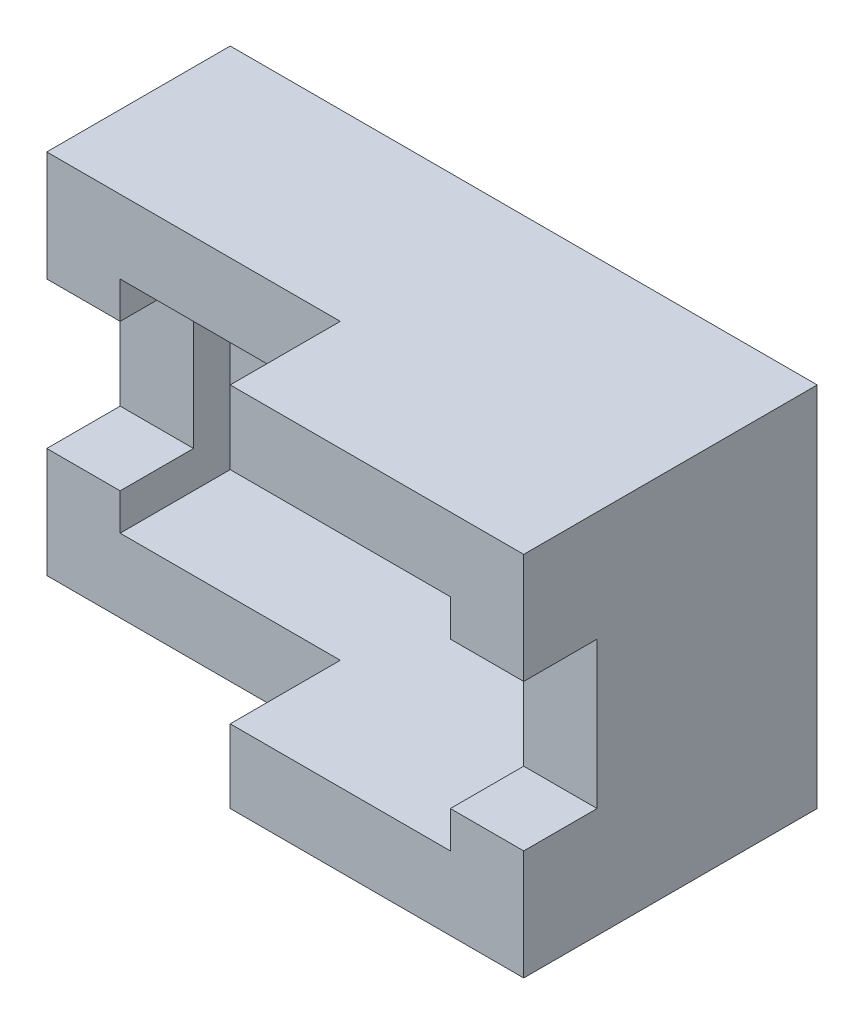
ISO-10303-21;
HEADER;
FILE_DESCRIPTION(('STEP AP214'),'2;1');
FILE_NAME('part.step','',(''),(''),'','','');
FILE_SCHEMA(('AUTOMOTIVE_DESIGN { 1 0 10303 214 1 1 1 1 }'));
ENDSEC;
DATA;
#1=APPLICATION_CONTEXT('core data for automotive mechanical design processes');
#2=APPLICATION_PROTOCOL_DEFINITION('international standard','automotive_design',2000,#1);
#3=PRODUCT_CONTEXT('',#1,'mechanical');
#4=PRODUCT('Part','Part','',(#3));
#5=PRODUCT_RELATED_PRODUCT_CATEGORY('part','',(#4));
#6=PRODUCT_DEFINITION_FORMATION('','',#4);
#7=PRODUCT_DEFINITION_CONTEXT('part definition',#1,'design');
#8=PRODUCT_DEFINITION('design','',#6,#7);
#9=PRODUCT_DEFINITION_SHAPE('','',#8);
#10=(LENGTH_UNIT() NAMED_UNIT(*) SI_UNIT(.MILLI.,.METRE.));
#11=(NAMED_UNIT(*) PLANE_ANGLE_UNIT() SI_UNIT($,.RADIAN.));
#12=(NAMED_UNIT(*) SI_UNIT($,.STERADIAN.) SOLID_ANGLE_UNIT());
#13=UNCERTAINTY_MEASURE_WITH_UNIT(LENGTH_MEASURE(1.E-05),#10,'distance_accuracy_value','');
#14=(GEOMETRIC_REPRESENTATION_CONTEXT(3) GLOBAL_UNCERTAINTY_ASSIGNED_CONTEXT((#13)) GLOBAL_UNIT_ASSIGNED_CONTEXT((#10,
#11,#12)) REPRESENTATION_CONTEXT('',''));
#15=CARTESIAN_POINT('',(0.,0.,0.));
#16=DIRECTION('',(0.,0.,1.));
#17=DIRECTION('',(1.,0.,0.));
#18=AXIS2_PLACEMENT_3D('',#15,#16,#17);
#19=CARTESIAN_POINT('',(0.,0.,50.));
#20=DIRECTION('',(0.,0.,-1.));
#21=DIRECTION('',(-1.,0.,0.));
#22=AXIS2_PLACEMENT_3D('',#19,#20,#21);
#23=PLANE('',#22);
#24=DIRECTION('',(0.,-1.,0.));
#25=VECTOR('',#24,1.);
#26=CARTESIAN_POINT('',(80.,0.,50.));
#27=LINE('',#26,#25);
#28=CARTESIAN_POINT('',(80.,20.,50.));
#29=VERTEX_POINT('',#28);
#30=CARTESIAN_POINT('',(80.,0.,50.));
#31=VERTEX_POINT('',#30);
#32=EDGE_CURVE('E239',#29,#31,#27,.T.);
#33=ORIENTED_EDGE('',*,*,#32,.F.);
#34=DIRECTION('',(1.,0.,0.));
#35=VECTOR('',#34,1.);
#36=CARTESIAN_POINT('',(140.,20.,50.));
#37=LINE('',#36,#35);
#38=CARTESIAN_POINT('',(20.,20.,50.));
#39=VERTEX_POINT('',#38);
#40=EDGE_CURVE('E286',#39,#29,#37,.T.);
#41=ORIENTED_EDGE('',*,*,#40,.F.);
#42=DIRECTION('',(0.,-1.,0.));
#43=VECTOR('',#42,1.);
#44=CARTESIAN_POINT('',(20.,80.,50.));
#45=LINE('',#44,#43);
#46=CARTESIAN_POINT('',(20.,30.,50.));
#47=VERTEX_POINT('',#46);
#48=EDGE_CURVE('E297',#47,#39,#45,.T.);
#49=ORIENTED_EDGE('',*,*,#48,.F.);
#50=DIRECTION('',(1.,0.,0.));
#51=VECTOR('',#50,1.);
#52=CARTESIAN_POINT('',(0.,30.,50.));
#53=LINE('',#52,#51);
#54=CARTESIAN_POINT('',(0.,30.,50.));
#55=VERTEX_POINT('',#54);
#56=EDGE_CURVE('E369',#55,#47,#53,.T.);
#57=ORIENTED_EDGE('',*,*,#56,.F.);
#58=DIRECTION('',(0.,-1.,0.));
#59=VECTOR('',#58,1.);
#60=CARTESIAN_POINT('',(0.,0.,50.));
#61=LINE('',#60,#59);
#62=CARTESIAN_POINT('',(0.,0.,50.));
#63=VERTEX_POINT('',#62);
#64=EDGE_CURVE('E406',#55,#63,#61,.T.);
#65=ORIENTED_EDGE('',*,*,#64,.T.);
#66=DIRECTION('',(1.,0.,0.));
#67=VECTOR('',#66,1.);
#68=CARTESIAN_POINT('',(0.,0.,50.));
#69=LINE('',#68,#67);
#70=EDGE_CURVE('E405',#63,#31,#69,.T.);
#71=ORIENTED_EDGE('',*,*,#70,.T.);
#72=EDGE_LOOP('',(#33,#41,#49,#57,#65,#71));
#73=FACE_BOUND('',#72,.T.);
#74=ADVANCED_FACE('F33',(#73),#23,.F.);
#75=DIRECTION('',(0.,-1.,0.));
#76=VECTOR('',#75,1.);
#77=CARTESIAN_POINT('',(80.,100.,50.));
#78=LINE('',#77,#76);
#79=CARTESIAN_POINT('',(80.,100.,50.));
#80=VERTEX_POINT('',#79);
#81=CARTESIAN_POINT('',(80.,80.,50.));
#82=VERTEX_POINT('',#81);
#83=EDGE_CURVE('E257',#80,#82,#78,.T.);
#84=ORIENTED_EDGE('',*,*,#83,.F.);
#85=DIRECTION('',(-1.,0.,0.));
#86=VECTOR('',#85,1.);
#87=CARTESIAN_POINT('',(0.,100.,50.));
#88=LINE('',#87,#86);
#89=CARTESIAN_POINT('',(0.,100.,50.));
#90=VERTEX_POINT('',#89);
#91=EDGE_CURVE('E409',#80,#90,#88,.T.);
#92=ORIENTED_EDGE('',*,*,#91,.T.);
#93=CARTESIAN_POINT('',(0.,70.,50.));
#94=VERTEX_POINT('',#93);
#95=EDGE_CURVE('E402',#90,#94,#61,.T.);
#96=ORIENTED_EDGE('',*,*,#95,.T.);
#97=DIRECTION('',(-1.,0.,0.));
#98=VECTOR('',#97,1.);
#99=CARTESIAN_POINT('',(0.,70.,50.));
#100=LINE('',#99,#98);
#101=CARTESIAN_POINT('',(20.,70.,50.));
#102=VERTEX_POINT('',#101);
#103=EDGE_CURVE('E379',#102,#94,#100,.T.);
#104=ORIENTED_EDGE('',*,*,#103,.F.);
#105=CARTESIAN_POINT('',(20.,80.,50.));
#106=VERTEX_POINT('',#105);
#107=EDGE_CURVE('E298',#106,#102,#45,.T.);
#108=ORIENTED_EDGE('',*,*,#107,.F.);
#109=DIRECTION('',(-1.,0.,0.));
#110=VECTOR('',#109,1.);
#111=CARTESIAN_POINT('',(140.,80.,50.));
#112=LINE('',#111,#110);
#113=EDGE_CURVE('E281',#82,#106,#112,.T.);
#114=ORIENTED_EDGE('',*,*,#113,.F.);
#115=EDGE_LOOP('',(#84,#92,#96,#104,#108,#114));
#116=FACE_BOUND('',#115,.T.);
#117=ADVANCED_FACE('F440',(#116),#23,.F.);
#118=CARTESIAN_POINT('',(0.,0.,50.));
#119=DIRECTION('',(1.,0.,0.));
#120=DIRECTION('',(0.,0.,-1.));
#121=AXIS2_PLACEMENT_3D('',#118,#119,#120);
#122=PLANE('',#121);
#123=DIRECTION('',(0.,-1.,0.));
#124=VECTOR('',#123,1.);
#125=CARTESIAN_POINT('',(0.,70.,30.));
#126=LINE('',#125,#124);
#127=CARTESIAN_POINT('',(0.,70.,30.));
#128=VERTEX_POINT('',#127);
#129=CARTESIAN_POINT('',(0.,30.,30.));
#130=VERTEX_POINT('',#129);
#131=EDGE_CURVE('E375',#128,#130,#126,.T.);
#132=ORIENTED_EDGE('',*,*,#131,.F.);
#133=DIRECTION('',(0.,0.,1.));
#134=VECTOR('',#133,1.);
#135=CARTESIAN_POINT('',(0.,70.,30.));
#136=LINE('',#135,#134);
#137=EDGE_CURVE('E392',#128,#94,#136,.T.);
#138=ORIENTED_EDGE('',*,*,#137,.T.);
#139=ORIENTED_EDGE('',*,*,#95,.F.);
#140=DIRECTION('',(0.,0.,-1.));
#141=VECTOR('',#140,1.);
#142=CARTESIAN_POINT('',(0.,100.,50.));
#143=LINE('',#142,#141);
#144=CARTESIAN_POINT('',(0.,100.,0.));
#145=VERTEX_POINT('',#144);
#146=EDGE_CURVE('E411',#90,#145,#143,.T.);
#147=ORIENTED_EDGE('',*,*,#146,.T.);
#148=DIRECTION('',(0.,-1.,0.));
#149=VECTOR('',#148,1.);
#150=CARTESIAN_POINT('',(0.,0.,0.));
#151=LINE('',#150,#149);
#152=CARTESIAN_POINT('',(0.,0.,0.));
#153=VERTEX_POINT('',#152);
#154=EDGE_CURVE('E395',#145,#153,#151,.T.);
#155=ORIENTED_EDGE('',*,*,#154,.T.);
#156=DIRECTION('',(0.,0.,-1.));
#157=VECTOR('',#156,1.);
#158=CARTESIAN_POINT('',(0.,0.,50.));
#159=LINE('',#158,#157);
#160=EDGE_CURVE('E11',#63,#153,#159,.T.);
#161=ORIENTED_EDGE('',*,*,#160,.F.);
#162=ORIENTED_EDGE('',*,*,#64,.F.);
#163=DIRECTION('',(0.,0.,1.));
#164=VECTOR('',#163,1.);
#165=CARTESIAN_POINT('',(0.,30.,30.));
#166=LINE('',#165,#164);
#167=EDGE_CURVE('E388',#130,#55,#166,.T.);
#168=ORIENTED_EDGE('',*,*,#167,.F.);
#169=EDGE_LOOP('',(#132,#138,#139,#147,#155,#161,#162,#168));
#170=FACE_BOUND('',#169,.T.);
#171=ADVANCED_FACE('F35',(#170),#122,.F.);
#172=CARTESIAN_POINT('',(0.,0.,50.));
#173=DIRECTION('',(0.,1.,0.));
#174=DIRECTION('',(0.,0.,1.));
#175=AXIS2_PLACEMENT_3D('',#172,#173,#174);
#176=PLANE('',#175);
#177=DIRECTION('',(1.,0.,0.));
#178=VECTOR('',#177,1.);
#179=CARTESIAN_POINT('',(0.,0.,0.));
#180=LINE('',#179,#178);
#181=CARTESIAN_POINT('',(160.,0.,0.));
#182=VERTEX_POINT('',#181);
#183=EDGE_CURVE('E223',#153,#182,#180,.T.);
#184=ORIENTED_EDGE('',*,*,#183,.T.);
#185=DIRECTION('',(0.,0.,-1.));
#186=VECTOR('',#185,1.);
#187=CARTESIAN_POINT('',(160.,0.,50.));
#188=LINE('',#187,#186);
#189=CARTESIAN_POINT('',(160.,0.,80.));
#190=VERTEX_POINT('',#189);
#191=EDGE_CURVE('E41',#190,#182,#188,.T.);
#192=ORIENTED_EDGE('',*,*,#191,.F.);
#193=DIRECTION('',(1.,0.,0.));
#194=VECTOR('',#193,1.);
#195=CARTESIAN_POINT('',(160.,0.,80.));
#196=LINE('',#195,#194);
#197=CARTESIAN_POINT('',(80.,0.,80.));
#198=VERTEX_POINT('',#197);
#199=EDGE_CURVE('E222',#198,#190,#196,.T.);
#200=ORIENTED_EDGE('',*,*,#199,.F.);
#201=DIRECTION('',(0.,0.,-1.));
#202=VECTOR('',#201,1.);
#203=CARTESIAN_POINT('',(80.,0.,80.));
#204=LINE('',#203,#202);
#205=EDGE_CURVE('E252',#198,#31,#204,.T.);
#206=ORIENTED_EDGE('',*,*,#205,.T.);
#207=ORIENTED_EDGE('',*,*,#70,.F.);
#208=ORIENTED_EDGE('',*,*,#160,.T.);
#209=EDGE_LOOP('',(#184,#192,#200,#206,#207,#208));
#210=FACE_BOUND('',#209,.T.);
#211=ADVANCED_FACE('F219',(#210),#176,.F.);
#212=CARTESIAN_POINT('',(160.,0.,50.));
#213=DIRECTION('',(-1.,0.,0.));
#214=DIRECTION('',(0.,0.,1.));
#215=AXIS2_PLACEMENT_3D('',#212,#213,#214);
#216=PLANE('',#215);
#217=DIRECTION('',(0.,1.,0.));
#218=VECTOR('',#217,1.);
#219=CARTESIAN_POINT('',(160.,70.,60.));
#220=LINE('',#219,#218);
#221=CARTESIAN_POINT('',(160.,30.,60.));
#222=VERTEX_POINT('',#221);
#223=CARTESIAN_POINT('',(160.,70.,60.));
#224=VERTEX_POINT('',#223);
#225=EDGE_CURVE('E452',#222,#224,#220,.T.);
#226=ORIENTED_EDGE('',*,*,#225,.F.);
#227=DIRECTION('',(0.,0.,1.));
#228=VECTOR('',#227,1.);
#229=CARTESIAN_POINT('',(160.,30.,30.));
#230=LINE('',#229,#228);
#231=CARTESIAN_POINT('',(160.,30.,80.));
#232=VERTEX_POINT('',#231);
#233=EDGE_CURVE('E48',#222,#232,#230,.T.);
#234=ORIENTED_EDGE('',*,*,#233,.T.);
#235=DIRECTION('',(0.,1.,0.));
#236=VECTOR('',#235,1.);
#237=CARTESIAN_POINT('',(160.,30.,80.));
#238=LINE('',#237,#236);
#239=EDGE_CURVE('E228',#190,#232,#238,.T.);
#240=ORIENTED_EDGE('',*,*,#239,.F.);
#241=ORIENTED_EDGE('',*,*,#191,.T.);
#242=DIRECTION('',(0.,1.,0.));
#243=VECTOR('',#242,1.);
#244=CARTESIAN_POINT('',(160.,0.,0.));
#245=LINE('',#244,#243);
#246=CARTESIAN_POINT('',(160.,100.,0.));
#247=VERTEX_POINT('',#246);
#248=EDGE_CURVE('E415',#182,#247,#245,.T.);
#249=ORIENTED_EDGE('',*,*,#248,.T.);
#250=DIRECTION('',(0.,0.,-1.));
#251=VECTOR('',#250,1.);
#252=CARTESIAN_POINT('',(160.,100.,50.));
#253=LINE('',#252,#251);
#254=CARTESIAN_POINT('',(160.,100.,80.));
#255=VERTEX_POINT('',#254);
#256=EDGE_CURVE('E226',#255,#247,#253,.T.);
#257=ORIENTED_EDGE('',*,*,#256,.F.);
#258=DIRECTION('',(0.,1.,0.));
#259=VECTOR('',#258,1.);
#260=CARTESIAN_POINT('',(160.,70.,80.));
#261=LINE('',#260,#259);
#262=CARTESIAN_POINT('',(160.,70.,80.));
#263=VERTEX_POINT('',#262);
#264=EDGE_CURVE('E272',#263,#255,#261,.T.);
#265=ORIENTED_EDGE('',*,*,#264,.F.);
#266=DIRECTION('',(0.,0.,1.));
#267=VECTOR('',#266,1.);
#268=CARTESIAN_POINT('',(160.,70.,30.));
#269=LINE('',#268,#267);
#270=EDGE_CURVE('E361',#224,#263,#269,.T.);
#271=ORIENTED_EDGE('',*,*,#270,.F.);
#272=EDGE_LOOP('',(#226,#234,#240,#241,#249,#257,#265,#271));
#273=FACE_BOUND('',#272,.T.);
#274=ADVANCED_FACE('F230',(#273),#216,.F.);
#275=CARTESIAN_POINT('',(0.,100.,50.));
#276=DIRECTION('',(0.,-1.,0.));
#277=DIRECTION('',(0.,0.,-1.));
#278=AXIS2_PLACEMENT_3D('',#275,#276,#277);
#279=PLANE('',#278);
#280=DIRECTION('',(-1.,0.,0.));
#281=VECTOR('',#280,1.);
#282=CARTESIAN_POINT('',(0.,100.,0.));
#283=LINE('',#282,#281);
#284=EDGE_CURVE('E417',#247,#145,#283,.T.);
#285=ORIENTED_EDGE('',*,*,#284,.T.);
#286=ORIENTED_EDGE('',*,*,#146,.F.);
#287=ORIENTED_EDGE('',*,*,#91,.F.);
#288=DIRECTION('',(0.,0.,-1.));
#289=VECTOR('',#288,1.);
#290=CARTESIAN_POINT('',(80.,100.,80.));
#291=LINE('',#290,#289);
#292=CARTESIAN_POINT('',(80.,100.,80.));
#293=VERTEX_POINT('',#292);
#294=EDGE_CURVE('E279',#293,#80,#291,.T.);
#295=ORIENTED_EDGE('',*,*,#294,.F.);
#296=DIRECTION('',(-1.,0.,0.));
#297=VECTOR('',#296,1.);
#298=CARTESIAN_POINT('',(160.,100.,80.));
#299=LINE('',#298,#297);
#300=EDGE_CURVE('E258',#255,#293,#299,.T.);
#301=ORIENTED_EDGE('',*,*,#300,.F.);
#302=ORIENTED_EDGE('',*,*,#256,.T.);
#303=EDGE_LOOP('',(#285,#286,#287,#295,#301,#302));
#304=FACE_BOUND('',#303,.T.);
#305=ADVANCED_FACE('F425',(#304),#279,.F.);
#306=CARTESIAN_POINT('',(0.,0.,0.));
#307=DIRECTION('',(0.,0.,-1.));
#308=DIRECTION('',(-1.,0.,0.));
#309=AXIS2_PLACEMENT_3D('',#306,#307,#308);
#310=PLANE('',#309);
#311=DIRECTION('',(0.,1.,0.));
#312=VECTOR('',#311,1.);
#313=CARTESIAN_POINT('',(90.,60.,0.));
#314=LINE('',#313,#312);
#315=CARTESIAN_POINT('',(90.,40.,0.));
#316=VERTEX_POINT('',#315);
#317=CARTESIAN_POINT('',(90.,60.,0.));
#318=VERTEX_POINT('',#317);
#319=EDGE_CURVE('E304',#316,#318,#314,.T.);
#320=ORIENTED_EDGE('',*,*,#319,.F.);
#321=DIRECTION('',(-1.,0.,0.));
#322=VECTOR('',#321,1.);
#323=CARTESIAN_POINT('',(90.,40.,0.));
#324=LINE('',#323,#322);
#325=CARTESIAN_POINT('',(120.,40.,0.));
#326=VERTEX_POINT('',#325);
#327=EDGE_CURVE('E315',#326,#316,#324,.T.);
#328=ORIENTED_EDGE('',*,*,#327,.F.);
#329=DIRECTION('',(0.,-1.,0.));
#330=VECTOR('',#329,1.);
#331=CARTESIAN_POINT('',(120.,60.,0.));
#332=LINE('',#331,#330);
#333=CARTESIAN_POINT('',(120.,60.,0.));
#334=VERTEX_POINT('',#333);
#335=EDGE_CURVE('E326',#334,#326,#332,.T.);
#336=ORIENTED_EDGE('',*,*,#335,.F.);
#337=DIRECTION('',(1.,0.,0.));
#338=VECTOR('',#337,1.);
#339=CARTESIAN_POINT('',(90.,60.,0.));
#340=LINE('',#339,#338);
#341=EDGE_CURVE('E323',#318,#334,#340,.T.);
#342=ORIENTED_EDGE('',*,*,#341,.F.);
#343=EDGE_LOOP('',(#320,#328,#336,#342));
#344=FACE_BOUND('',#343,.T.);
#345=DIRECTION('',(0.,1.,0.));
#346=VECTOR('',#345,1.);
#347=CARTESIAN_POINT('',(40.,60.,0.));
#348=LINE('',#347,#346);
#349=CARTESIAN_POINT('',(40.,40.,0.));
#350=VERTEX_POINT('',#349);
#351=CARTESIAN_POINT('',(40.,60.,0.));
#352=VERTEX_POINT('',#351);
#353=EDGE_CURVE('E333',#350,#352,#348,.T.);
#354=ORIENTED_EDGE('',*,*,#353,.F.);
#355=DIRECTION('',(-1.,0.,0.));
#356=VECTOR('',#355,1.);
#357=CARTESIAN_POINT('',(40.,40.,0.));
#358=LINE('',#357,#356);
#359=CARTESIAN_POINT('',(70.,40.,0.));
#360=VERTEX_POINT('',#359);
#361=EDGE_CURVE('E343',#360,#350,#358,.T.);
#362=ORIENTED_EDGE('',*,*,#361,.F.);
#363=DIRECTION('',(0.,-1.,0.));
#364=VECTOR('',#363,1.);
#365=CARTESIAN_POINT('',(70.,60.,0.));
#366=LINE('',#365,#364);
#367=CARTESIAN_POINT('',(70.,60.,0.));
#368=VERTEX_POINT('',#367);
#369=EDGE_CURVE('E354',#368,#360,#366,.T.);
#370=ORIENTED_EDGE('',*,*,#369,.F.);
#371=DIRECTION('',(1.,0.,0.));
#372=VECTOR('',#371,1.);
#373=CARTESIAN_POINT('',(40.,60.,0.));
#374=LINE('',#373,#372);
#375=EDGE_CURVE('E351',#352,#368,#374,.T.);
#376=ORIENTED_EDGE('',*,*,#375,.F.);
#377=EDGE_LOOP('',(#354,#362,#370,#376));
#378=FACE_BOUND('',#377,.T.);
#379=ORIENTED_EDGE('',*,*,#154,.F.);
#380=ORIENTED_EDGE('',*,*,#284,.F.);
#381=ORIENTED_EDGE('',*,*,#248,.F.);
#382=ORIENTED_EDGE('',*,*,#183,.F.);
#383=EDGE_LOOP('',(#379,#380,#381,#382));
#384=FACE_BOUND('',#383,.T.);
#385=ADVANCED_FACE('F431',(#344,#378,#384),#310,.T.);
#386=CARTESIAN_POINT('',(0.,70.,30.));
#387=DIRECTION('',(0.,1.,0.));
#388=DIRECTION('',(0.,0.,1.));
#389=AXIS2_PLACEMENT_3D('',#386,#387,#388);
#390=PLANE('',#389);
#391=ORIENTED_EDGE('',*,*,#103,.T.);
#392=ORIENTED_EDGE('',*,*,#137,.F.);
#393=DIRECTION('',(-1.,0.,0.));
#394=VECTOR('',#393,1.);
#395=CARTESIAN_POINT('',(0.,70.,30.));
#396=LINE('',#395,#394);
#397=CARTESIAN_POINT('',(20.,70.,30.));
#398=VERTEX_POINT('',#397);
#399=EDGE_CURVE('E385',#398,#128,#396,.T.);
#400=ORIENTED_EDGE('',*,*,#399,.F.);
#401=DIRECTION('',(0.,0.,1.));
#402=VECTOR('',#401,1.);
#403=CARTESIAN_POINT('',(20.,70.,30.));
#404=LINE('',#403,#402);
#405=EDGE_CURVE('E396',#398,#102,#404,.T.);
#406=ORIENTED_EDGE('',*,*,#405,.T.);
#407=EDGE_LOOP('',(#391,#392,#400,#406));
#408=FACE_BOUND('',#407,.T.);
#409=ADVANCED_FACE('F488',(#408),#390,.F.);
#410=CARTESIAN_POINT('',(0.,30.,30.));
#411=DIRECTION('',(0.,-1.,0.));
#412=DIRECTION('',(0.,0.,-1.));
#413=AXIS2_PLACEMENT_3D('',#410,#411,#412);
#414=PLANE('',#413);
#415=ORIENTED_EDGE('',*,*,#56,.T.);
#416=DIRECTION('',(0.,0.,1.));
#417=VECTOR('',#416,1.);
#418=CARTESIAN_POINT('',(20.,30.,30.));
#419=LINE('',#418,#417);
#420=CARTESIAN_POINT('',(20.,30.,30.));
#421=VERTEX_POINT('',#420);
#422=EDGE_CURVE('E399',#421,#47,#419,.T.);
#423=ORIENTED_EDGE('',*,*,#422,.F.);
#424=DIRECTION('',(1.,0.,0.));
#425=VECTOR('',#424,1.);
#426=CARTESIAN_POINT('',(0.,30.,30.));
#427=LINE('',#426,#425);
#428=EDGE_CURVE('E378',#130,#421,#427,.T.);
#429=ORIENTED_EDGE('',*,*,#428,.F.);
#430=ORIENTED_EDGE('',*,*,#167,.T.);
#431=EDGE_LOOP('',(#415,#423,#429,#430));
#432=FACE_BOUND('',#431,.T.);
#433=ADVANCED_FACE('F482',(#432),#414,.F.);
#434=CARTESIAN_POINT('',(0.,0.,30.));
#435=DIRECTION('',(0.,0.,1.));
#436=DIRECTION('',(1.,0.,0.));
#437=AXIS2_PLACEMENT_3D('',#434,#435,#436);
#438=PLANE('',#437);
#439=ORIENTED_EDGE('',*,*,#131,.T.);
#440=ORIENTED_EDGE('',*,*,#428,.T.);
#441=DIRECTION('',(0.,1.,0.));
#442=VECTOR('',#441,1.);
#443=CARTESIAN_POINT('',(20.,70.,30.));
#444=LINE('',#443,#442);
#445=EDGE_CURVE('E382',#421,#398,#444,.T.);
#446=ORIENTED_EDGE('',*,*,#445,.T.);
#447=ORIENTED_EDGE('',*,*,#399,.T.);
#448=EDGE_LOOP('',(#439,#440,#446,#447));
#449=FACE_BOUND('',#448,.T.);
#450=ADVANCED_FACE('F485',(#449),#438,.T.);
#451=CARTESIAN_POINT('',(160.,30.,30.));
#452=DIRECTION('',(0.,-1.,0.));
#453=DIRECTION('',(1.,0.,0.));
#454=AXIS2_PLACEMENT_3D('',#451,#452,#453);
#455=PLANE('',#454);
#456=ORIENTED_EDGE('',*,*,#233,.F.);
#457=DIRECTION('',(-1.,0.,0.));
#458=VECTOR('',#457,1.);
#459=CARTESIAN_POINT('',(160.,30.,60.));
#460=LINE('',#459,#458);
#461=CARTESIAN_POINT('',(140.,30.,60.));
#462=VERTEX_POINT('',#461);
#463=EDGE_CURVE('E243',#222,#462,#460,.T.);
#464=ORIENTED_EDGE('',*,*,#463,.T.);
#465=DIRECTION('',(0.,0.,1.));
#466=VECTOR('',#465,1.);
#467=CARTESIAN_POINT('',(140.,30.,30.));
#468=LINE('',#467,#466);
#469=CARTESIAN_POINT('',(140.,30.,80.));
#470=VERTEX_POINT('',#469);
#471=EDGE_CURVE('E370',#462,#470,#468,.T.);
#472=ORIENTED_EDGE('',*,*,#471,.T.);
#473=DIRECTION('',(-1.,0.,0.));
#474=VECTOR('',#473,1.);
#475=CARTESIAN_POINT('',(140.,30.,80.));
#476=LINE('',#475,#474);
#477=EDGE_CURVE('E233',#232,#470,#476,.T.);
#478=ORIENTED_EDGE('',*,*,#477,.F.);
#479=EDGE_LOOP('',(#456,#464,#472,#478));
#480=FACE_BOUND('',#479,.T.);
#481=ADVANCED_FACE('F465',(#480),#455,.F.);
#482=CARTESIAN_POINT('',(160.,70.,30.));
#483=DIRECTION('',(0.,1.,0.));
#484=DIRECTION('',(0.,0.,1.));
#485=AXIS2_PLACEMENT_3D('',#482,#483,#484);
#486=PLANE('',#485);
#487=DIRECTION('',(0.,0.,1.));
#488=VECTOR('',#487,1.);
#489=CARTESIAN_POINT('',(140.,70.,30.));
#490=LINE('',#489,#488);
#491=CARTESIAN_POINT('',(140.,70.,60.));
#492=VERTEX_POINT('',#491);
#493=CARTESIAN_POINT('',(140.,70.,80.));
#494=VERTEX_POINT('',#493);
#495=EDGE_CURVE('E372',#492,#494,#490,.T.);
#496=ORIENTED_EDGE('',*,*,#495,.F.);
#497=DIRECTION('',(-1.,0.,0.));
#498=VECTOR('',#497,1.);
#499=CARTESIAN_POINT('',(160.,70.,60.));
#500=LINE('',#499,#498);
#501=EDGE_CURVE('E56',#224,#492,#500,.T.);
#502=ORIENTED_EDGE('',*,*,#501,.F.);
#503=ORIENTED_EDGE('',*,*,#270,.T.);
#504=DIRECTION('',(1.,0.,0.));
#505=VECTOR('',#504,1.);
#506=CARTESIAN_POINT('',(140.,70.,80.));
#507=LINE('',#506,#505);
#508=EDGE_CURVE('E269',#494,#263,#507,.T.);
#509=ORIENTED_EDGE('',*,*,#508,.F.);
#510=EDGE_LOOP('',(#496,#502,#503,#509));
#511=FACE_BOUND('',#510,.T.);
#512=ADVANCED_FACE('F542',(#511),#486,.F.);
#513=CARTESIAN_POINT('',(40.,60.,20.));
#514=DIRECTION('',(-1.,0.,0.));
#515=DIRECTION('',(0.,-1.,0.));
#516=AXIS2_PLACEMENT_3D('',#513,#514,#515);
#517=PLANE('',#516);
#518=ORIENTED_EDGE('',*,*,#353,.T.);
#519=DIRECTION('',(0.,0.,-1.));
#520=VECTOR('',#519,1.);
#521=CARTESIAN_POINT('',(40.,60.,20.));
#522=LINE('',#521,#520);
#523=CARTESIAN_POINT('',(40.,60.,20.));
#524=VERTEX_POINT('',#523);
#525=EDGE_CURVE('E349',#524,#352,#522,.T.);
#526=ORIENTED_EDGE('',*,*,#525,.F.);
#527=DIRECTION('',(0.,1.,0.));
#528=VECTOR('',#527,1.);
#529=CARTESIAN_POINT('',(40.,60.,20.));
#530=LINE('',#529,#528);
#531=CARTESIAN_POINT('',(40.,40.,20.));
#532=VERTEX_POINT('',#531);
#533=EDGE_CURVE('E340',#532,#524,#530,.T.);
#534=ORIENTED_EDGE('',*,*,#533,.F.);
#535=DIRECTION('',(0.,0.,-1.));
#536=VECTOR('',#535,1.);
#537=CARTESIAN_POINT('',(40.,40.,20.));
#538=LINE('',#537,#536);
#539=EDGE_CURVE('E359',#532,#350,#538,.T.);
#540=ORIENTED_EDGE('',*,*,#539,.T.);
#541=EDGE_LOOP('',(#518,#526,#534,#540));
#542=FACE_BOUND('',#541,.T.);
#543=ADVANCED_FACE('F520',(#542),#517,.F.);
#544=CARTESIAN_POINT('',(40.,40.,20.));
#545=DIRECTION('',(0.,-1.,0.));
#546=DIRECTION('',(1.,0.,0.));
#547=AXIS2_PLACEMENT_3D('',#544,#545,#546);
#548=PLANE('',#547);
#549=ORIENTED_EDGE('',*,*,#361,.T.);
#550=ORIENTED_EDGE('',*,*,#539,.F.);
#551=DIRECTION('',(-1.,0.,0.));
#552=VECTOR('',#551,1.);
#553=CARTESIAN_POINT('',(40.,40.,20.));
#554=LINE('',#553,#552);
#555=CARTESIAN_POINT('',(70.,40.,20.));
#556=VERTEX_POINT('',#555);
#557=EDGE_CURVE('E347',#556,#532,#554,.T.);
#558=ORIENTED_EDGE('',*,*,#557,.F.);
#559=DIRECTION('',(0.,0.,-1.));
#560=VECTOR('',#559,1.);
#561=CARTESIAN_POINT('',(70.,40.,20.));
#562=LINE('',#561,#560);
#563=EDGE_CURVE('E362',#556,#360,#562,.T.);
#564=ORIENTED_EDGE('',*,*,#563,.T.);
#565=EDGE_LOOP('',(#549,#550,#558,#564));
#566=FACE_BOUND('',#565,.T.);
#567=ADVANCED_FACE('F517',(#566),#548,.F.);
#568=CARTESIAN_POINT('',(70.,60.,20.));
#569=DIRECTION('',(1.,0.,0.));
#570=DIRECTION('',(0.,0.,-1.));
#571=AXIS2_PLACEMENT_3D('',#568,#569,#570);
#572=PLANE('',#571);
#573=ORIENTED_EDGE('',*,*,#369,.T.);
#574=ORIENTED_EDGE('',*,*,#563,.F.);
#575=DIRECTION('',(0.,-1.,0.));
#576=VECTOR('',#575,1.);
#577=CARTESIAN_POINT('',(70.,60.,20.));
#578=LINE('',#577,#576);
#579=CARTESIAN_POINT('',(70.,60.,20.));
#580=VERTEX_POINT('',#579);
#581=EDGE_CURVE('E345',#580,#556,#578,.T.);
#582=ORIENTED_EDGE('',*,*,#581,.F.);
#583=DIRECTION('',(0.,0.,-1.));
#584=VECTOR('',#583,1.);
#585=CARTESIAN_POINT('',(70.,60.,20.));
#586=LINE('',#585,#584);
#587=EDGE_CURVE('E364',#580,#368,#586,.T.);
#588=ORIENTED_EDGE('',*,*,#587,.T.);
#589=EDGE_LOOP('',(#573,#574,#582,#588));
#590=FACE_BOUND('',#589,.T.);
#591=ADVANCED_FACE('F512',(#590),#572,.F.);
#592=CARTESIAN_POINT('',(40.,60.,20.));
#593=DIRECTION('',(0.,1.,0.));
#594=DIRECTION('',(0.,0.,1.));
#595=AXIS2_PLACEMENT_3D('',#592,#593,#594);
#596=PLANE('',#595);
#597=ORIENTED_EDGE('',*,*,#375,.T.);
#598=ORIENTED_EDGE('',*,*,#587,.F.);
#599=DIRECTION('',(1.,0.,0.));
#600=VECTOR('',#599,1.);
#601=CARTESIAN_POINT('',(40.,60.,20.));
#602=LINE('',#601,#600);
#603=EDGE_CURVE('E342',#524,#580,#602,.T.);
#604=ORIENTED_EDGE('',*,*,#603,.F.);
#605=ORIENTED_EDGE('',*,*,#525,.T.);
#606=EDGE_LOOP('',(#597,#598,#604,#605));
#607=FACE_BOUND('',#606,.T.);
#608=ADVANCED_FACE('F508',(#607),#596,.F.);
#609=CARTESIAN_POINT('',(90.,60.,20.));
#610=DIRECTION('',(-1.,0.,0.));
#611=DIRECTION('',(0.,0.,1.));
#612=AXIS2_PLACEMENT_3D('',#609,#610,#611);
#613=PLANE('',#612);
#614=ORIENTED_EDGE('',*,*,#319,.T.);
#615=DIRECTION('',(0.,0.,-1.));
#616=VECTOR('',#615,1.);
#617=CARTESIAN_POINT('',(90.,60.,20.));
#618=LINE('',#617,#616);
#619=CARTESIAN_POINT('',(90.,60.,20.));
#620=VERTEX_POINT('',#619);
#621=EDGE_CURVE('E321',#620,#318,#618,.T.);
#622=ORIENTED_EDGE('',*,*,#621,.F.);
#623=DIRECTION('',(0.,1.,0.));
#624=VECTOR('',#623,1.);
#625=CARTESIAN_POINT('',(90.,60.,20.));
#626=LINE('',#625,#624);
#627=CARTESIAN_POINT('',(90.,40.,20.));
#628=VERTEX_POINT('',#627);
#629=EDGE_CURVE('E312',#628,#620,#626,.T.);
#630=ORIENTED_EDGE('',*,*,#629,.F.);
#631=DIRECTION('',(0.,0.,-1.));
#632=VECTOR('',#631,1.);
#633=CARTESIAN_POINT('',(90.,40.,20.));
#634=LINE('',#633,#632);
#635=EDGE_CURVE('E331',#628,#316,#634,.T.);
#636=ORIENTED_EDGE('',*,*,#635,.T.);
#637=EDGE_LOOP('',(#614,#622,#630,#636));
#638=FACE_BOUND('',#637,.T.);
#639=ADVANCED_FACE('F551',(#638),#613,.F.);
#640=CARTESIAN_POINT('',(90.,40.,20.));
#641=DIRECTION('',(0.,-1.,0.));
#642=DIRECTION('',(1.,0.,0.));
#643=AXIS2_PLACEMENT_3D('',#640,#641,#642);
#644=PLANE('',#643);
#645=ORIENTED_EDGE('',*,*,#327,.T.);
#646=ORIENTED_EDGE('',*,*,#635,.F.);
#647=DIRECTION('',(-1.,0.,0.));
#648=VECTOR('',#647,1.);
#649=CARTESIAN_POINT('',(90.,40.,20.));
#650=LINE('',#649,#648);
#651=CARTESIAN_POINT('',(120.,40.,20.));
#652=VERTEX_POINT('',#651);
#653=EDGE_CURVE('E319',#652,#628,#650,.T.);
#654=ORIENTED_EDGE('',*,*,#653,.F.);
#655=DIRECTION('',(0.,0.,-1.));
#656=VECTOR('',#655,1.);
#657=CARTESIAN_POINT('',(120.,40.,20.));
#658=LINE('',#657,#656);
#659=EDGE_CURVE('E334',#652,#326,#658,.T.);
#660=ORIENTED_EDGE('',*,*,#659,.T.);
#661=EDGE_LOOP('',(#645,#646,#654,#660));
#662=FACE_BOUND('',#661,.T.);
#663=ADVANCED_FACE('F558',(#662),#644,.F.);
#664=CARTESIAN_POINT('',(120.,60.,20.));
#665=DIRECTION('',(1.,0.,0.));
#666=DIRECTION('',(0.,0.,-1.));
#667=AXIS2_PLACEMENT_3D('',#664,#665,#666);
#668=PLANE('',#667);
#669=ORIENTED_EDGE('',*,*,#335,.T.);
#670=ORIENTED_EDGE('',*,*,#659,.F.);
#671=DIRECTION('',(0.,-1.,0.));
#672=VECTOR('',#671,1.);
#673=CARTESIAN_POINT('',(120.,60.,20.));
#674=LINE('',#673,#672);
#675=CARTESIAN_POINT('',(120.,60.,20.));
#676=VERTEX_POINT('',#675);
#677=EDGE_CURVE('E317',#676,#652,#674,.T.);
#678=ORIENTED_EDGE('',*,*,#677,.F.);
#679=DIRECTION('',(0.,0.,-1.));
#680=VECTOR('',#679,1.);
#681=CARTESIAN_POINT('',(120.,60.,20.));
#682=LINE('',#681,#680);
#683=EDGE_CURVE('E336',#676,#334,#682,.T.);
#684=ORIENTED_EDGE('',*,*,#683,.T.);
#685=EDGE_LOOP('',(#669,#670,#678,#684));
#686=FACE_BOUND('',#685,.T.);
#687=ADVANCED_FACE('F563',(#686),#668,.F.);
#688=CARTESIAN_POINT('',(90.,60.,20.));
#689=DIRECTION('',(0.,1.,0.));
#690=DIRECTION('',(-1.,0.,0.));
#691=AXIS2_PLACEMENT_3D('',#688,#689,#690);
#692=PLANE('',#691);
#693=ORIENTED_EDGE('',*,*,#341,.T.);
#694=ORIENTED_EDGE('',*,*,#683,.F.);
#695=DIRECTION('',(1.,0.,0.));
#696=VECTOR('',#695,1.);
#697=CARTESIAN_POINT('',(90.,60.,20.));
#698=LINE('',#697,#696);
#699=EDGE_CURVE('E314',#620,#676,#698,.T.);
#700=ORIENTED_EDGE('',*,*,#699,.F.);
#701=ORIENTED_EDGE('',*,*,#621,.T.);
#702=EDGE_LOOP('',(#693,#694,#700,#701));
#703=FACE_BOUND('',#702,.T.);
#704=ADVANCED_FACE('F560',(#703),#692,.F.);
#705=CARTESIAN_POINT('',(20.,80.,20.));
#706=DIRECTION('',(-1.,0.,0.));
#707=DIRECTION('',(0.,-1.,0.));
#708=AXIS2_PLACEMENT_3D('',#705,#706,#707);
#709=PLANE('',#708);
#710=ORIENTED_EDGE('',*,*,#445,.F.);
#711=ORIENTED_EDGE('',*,*,#422,.T.);
#712=ORIENTED_EDGE('',*,*,#48,.T.);
#713=DIRECTION('',(0.,0.,1.));
#714=VECTOR('',#713,1.);
#715=CARTESIAN_POINT('',(20.,20.,20.));
#716=LINE('',#715,#714);
#717=CARTESIAN_POINT('',(20.,20.,20.));
#718=VERTEX_POINT('',#717);
#719=EDGE_CURVE('E305',#718,#39,#716,.T.);
#720=ORIENTED_EDGE('',*,*,#719,.F.);
#721=DIRECTION('',(0.,-1.,0.));
#722=VECTOR('',#721,1.);
#723=CARTESIAN_POINT('',(20.,80.,20.));
#724=LINE('',#723,#722);
#725=CARTESIAN_POINT('',(20.,80.,20.));
#726=VERTEX_POINT('',#725);
#727=EDGE_CURVE('E289',#726,#718,#724,.T.);
#728=ORIENTED_EDGE('',*,*,#727,.F.);
#729=DIRECTION('',(0.,0.,1.));
#730=VECTOR('',#729,1.);
#731=CARTESIAN_POINT('',(20.,80.,20.));
#732=LINE('',#731,#730);
#733=EDGE_CURVE('E308',#726,#106,#732,.T.);
#734=ORIENTED_EDGE('',*,*,#733,.T.);
#735=ORIENTED_EDGE('',*,*,#107,.T.);
#736=ORIENTED_EDGE('',*,*,#405,.F.);
#737=EDGE_LOOP('',(#710,#711,#712,#720,#728,#734,#735,#736));
#738=FACE_BOUND('',#737,.T.);
#739=ADVANCED_FACE('F490',(#738),#709,.F.);
#740=CARTESIAN_POINT('',(140.,80.,20.));
#741=DIRECTION('',(1.,0.,0.));
#742=DIRECTION('',(0.,0.,-1.));
#743=AXIS2_PLACEMENT_3D('',#740,#741,#742);
#744=PLANE('',#743);
#745=DIRECTION('',(0.,1.,0.));
#746=VECTOR('',#745,1.);
#747=CARTESIAN_POINT('',(140.,70.,60.));
#748=LINE('',#747,#746);
#749=EDGE_CURVE('E457',#462,#492,#748,.T.);
#750=ORIENTED_EDGE('',*,*,#749,.T.);
#751=ORIENTED_EDGE('',*,*,#495,.T.);
#752=DIRECTION('',(0.,-1.,0.));
#753=VECTOR('',#752,1.);
#754=CARTESIAN_POINT('',(140.,80.,80.));
#755=LINE('',#754,#753);
#756=CARTESIAN_POINT('',(140.,80.,80.));
#757=VERTEX_POINT('',#756);
#758=EDGE_CURVE('E266',#757,#494,#755,.T.);
#759=ORIENTED_EDGE('',*,*,#758,.F.);
#760=DIRECTION('',(0.,0.,1.));
#761=VECTOR('',#760,1.);
#762=CARTESIAN_POINT('',(140.,80.,20.));
#763=LINE('',#762,#761);
#764=CARTESIAN_POINT('',(140.,80.,20.));
#765=VERTEX_POINT('',#764);
#766=EDGE_CURVE('E295',#765,#757,#763,.T.);
#767=ORIENTED_EDGE('',*,*,#766,.F.);
#768=DIRECTION('',(0.,1.,0.));
#769=VECTOR('',#768,1.);
#770=CARTESIAN_POINT('',(140.,80.,20.));
#771=LINE('',#770,#769);
#772=CARTESIAN_POINT('',(140.,20.,20.));
#773=VERTEX_POINT('',#772);
#774=EDGE_CURVE('E282',#773,#765,#771,.T.);
#775=ORIENTED_EDGE('',*,*,#774,.F.);
#776=DIRECTION('',(0.,0.,1.));
#777=VECTOR('',#776,1.);
#778=CARTESIAN_POINT('',(140.,20.,20.));
#779=LINE('',#778,#777);
#780=CARTESIAN_POINT('',(140.,20.,80.));
#781=VERTEX_POINT('',#780);
#782=EDGE_CURVE('E302',#773,#781,#779,.T.);
#783=ORIENTED_EDGE('',*,*,#782,.T.);
#784=DIRECTION('',(0.,-1.,0.));
#785=VECTOR('',#784,1.);
#786=CARTESIAN_POINT('',(140.,20.,80.));
#787=LINE('',#786,#785);
#788=EDGE_CURVE('E247',#470,#781,#787,.T.);
#789=ORIENTED_EDGE('',*,*,#788,.F.);
#790=ORIENTED_EDGE('',*,*,#471,.F.);
#791=EDGE_LOOP('',(#750,#751,#759,#767,#775,#783,#789,#790));
#792=FACE_BOUND('',#791,.T.);
#793=ADVANCED_FACE('F462',(#792),#744,.F.);
#794=CARTESIAN_POINT('',(0.,0.,20.));
#795=DIRECTION('',(0.,0.,-1.));
#796=DIRECTION('',(-1.,0.,0.));
#797=AXIS2_PLACEMENT_3D('',#794,#795,#796);
#798=PLANE('',#797);
#799=ORIENTED_EDGE('',*,*,#699,.T.);
#800=ORIENTED_EDGE('',*,*,#677,.T.);
#801=ORIENTED_EDGE('',*,*,#653,.T.);
#802=ORIENTED_EDGE('',*,*,#629,.T.);
#803=EDGE_LOOP('',(#799,#800,#801,#802));
#804=FACE_BOUND('',#803,.T.);
#805=ORIENTED_EDGE('',*,*,#774,.T.);
#806=DIRECTION('',(-1.,0.,0.));
#807=VECTOR('',#806,1.);
#808=CARTESIAN_POINT('',(140.,80.,20.));
#809=LINE('',#808,#807);
#810=EDGE_CURVE('E285',#765,#726,#809,.T.);
#811=ORIENTED_EDGE('',*,*,#810,.T.);
#812=ORIENTED_EDGE('',*,*,#727,.T.);
#813=DIRECTION('',(1.,0.,0.));
#814=VECTOR('',#813,1.);
#815=CARTESIAN_POINT('',(140.,20.,20.));
#816=LINE('',#815,#814);
#817=EDGE_CURVE('E292',#718,#773,#816,.T.);
#818=ORIENTED_EDGE('',*,*,#817,.T.);
#819=EDGE_LOOP('',(#805,#811,#812,#818));
#820=FACE_BOUND('',#819,.T.);
#821=ORIENTED_EDGE('',*,*,#603,.T.);
#822=ORIENTED_EDGE('',*,*,#581,.T.);
#823=ORIENTED_EDGE('',*,*,#557,.T.);
#824=ORIENTED_EDGE('',*,*,#533,.T.);
#825=EDGE_LOOP('',(#821,#822,#823,#824));
#826=FACE_BOUND('',#825,.T.);
#827=ADVANCED_FACE('F496',(#804,#820,#826),#798,.F.);
#828=CARTESIAN_POINT('',(140.,20.,20.));
#829=DIRECTION('',(0.,-1.,0.));
#830=DIRECTION('',(1.,0.,0.));
#831=AXIS2_PLACEMENT_3D('',#828,#829,#830);
#832=PLANE('',#831);
#833=ORIENTED_EDGE('',*,*,#40,.T.);
#834=DIRECTION('',(0.,0.,-1.));
#835=VECTOR('',#834,1.);
#836=CARTESIAN_POINT('',(80.,20.,80.));
#837=LINE('',#836,#835);
#838=CARTESIAN_POINT('',(80.,20.,80.));
#839=VERTEX_POINT('',#838);
#840=EDGE_CURVE('E255',#839,#29,#837,.T.);
#841=ORIENTED_EDGE('',*,*,#840,.F.);
#842=DIRECTION('',(-1.,0.,0.));
#843=VECTOR('',#842,1.);
#844=CARTESIAN_POINT('',(80.,20.,80.));
#845=LINE('',#844,#843);
#846=EDGE_CURVE('E250',#781,#839,#845,.T.);
#847=ORIENTED_EDGE('',*,*,#846,.F.);
#848=ORIENTED_EDGE('',*,*,#782,.F.);
#849=ORIENTED_EDGE('',*,*,#817,.F.);
#850=ORIENTED_EDGE('',*,*,#719,.T.);
#851=EDGE_LOOP('',(#833,#841,#847,#848,#849,#850));
#852=FACE_BOUND('',#851,.T.);
#853=ADVANCED_FACE('F469',(#852),#832,.F.);
#854=CARTESIAN_POINT('',(140.,80.,20.));
#855=DIRECTION('',(0.,1.,0.));
#856=DIRECTION('',(-1.,0.,0.));
#857=AXIS2_PLACEMENT_3D('',#854,#855,#856);
#858=PLANE('',#857);
#859=ORIENTED_EDGE('',*,*,#766,.T.);
#860=DIRECTION('',(1.,0.,0.));
#861=VECTOR('',#860,1.);
#862=CARTESIAN_POINT('',(80.,80.,80.));
#863=LINE('',#862,#861);
#864=CARTESIAN_POINT('',(80.,80.,80.));
#865=VERTEX_POINT('',#864);
#866=EDGE_CURVE('E263',#865,#757,#863,.T.);
#867=ORIENTED_EDGE('',*,*,#866,.F.);
#868=DIRECTION('',(0.,0.,-1.));
#869=VECTOR('',#868,1.);
#870=CARTESIAN_POINT('',(80.,80.,80.));
#871=LINE('',#870,#869);
#872=EDGE_CURVE('E275',#865,#82,#871,.T.);
#873=ORIENTED_EDGE('',*,*,#872,.T.);
#874=ORIENTED_EDGE('',*,*,#113,.T.);
#875=ORIENTED_EDGE('',*,*,#733,.F.);
#876=ORIENTED_EDGE('',*,*,#810,.F.);
#877=EDGE_LOOP('',(#859,#867,#873,#874,#875,#876));
#878=FACE_BOUND('',#877,.T.);
#879=ADVANCED_FACE('F494',(#878),#858,.F.);
#880=CARTESIAN_POINT('',(80.,100.,80.));
#881=DIRECTION('',(1.,0.,0.));
#882=DIRECTION('',(0.,0.,-1.));
#883=AXIS2_PLACEMENT_3D('',#880,#881,#882);
#884=PLANE('',#883);
#885=ORIENTED_EDGE('',*,*,#83,.T.);
#886=ORIENTED_EDGE('',*,*,#872,.F.);
#887=DIRECTION('',(0.,-1.,0.));
#888=VECTOR('',#887,1.);
#889=CARTESIAN_POINT('',(80.,100.,80.));
#890=LINE('',#889,#888);
#891=EDGE_CURVE('E261',#293,#865,#890,.T.);
#892=ORIENTED_EDGE('',*,*,#891,.F.);
#893=ORIENTED_EDGE('',*,*,#294,.T.);
#894=EDGE_LOOP('',(#885,#886,#892,#893));
#895=FACE_BOUND('',#894,.T.);
#896=ADVANCED_FACE('F446',(#895),#884,.F.);
#897=CARTESIAN_POINT('',(0.,0.,80.));
#898=DIRECTION('',(0.,0.,1.));
#899=DIRECTION('',(1.,0.,0.));
#900=AXIS2_PLACEMENT_3D('',#897,#898,#899);
#901=PLANE('',#900);
#902=ORIENTED_EDGE('',*,*,#300,.T.);
#903=ORIENTED_EDGE('',*,*,#891,.T.);
#904=ORIENTED_EDGE('',*,*,#866,.T.);
#905=ORIENTED_EDGE('',*,*,#758,.T.);
#906=ORIENTED_EDGE('',*,*,#508,.T.);
#907=ORIENTED_EDGE('',*,*,#264,.T.);
#908=EDGE_LOOP('',(#902,#903,#904,#905,#906,#907));
#909=FACE_BOUND('',#908,.T.);
#910=ADVANCED_FACE('F449',(#909),#901,.T.);
#911=CARTESIAN_POINT('',(80.,0.,80.));
#912=DIRECTION('',(1.,0.,0.));
#913=DIRECTION('',(0.,1.,0.));
#914=AXIS2_PLACEMENT_3D('',#911,#912,#913);
#915=PLANE('',#914);
#916=ORIENTED_EDGE('',*,*,#32,.T.);
#917=ORIENTED_EDGE('',*,*,#205,.F.);
#918=DIRECTION('',(0.,-1.,0.));
#919=VECTOR('',#918,1.);
#920=CARTESIAN_POINT('',(80.,0.,80.));
#921=LINE('',#920,#919);
#922=EDGE_CURVE('E237',#839,#198,#921,.T.);
#923=ORIENTED_EDGE('',*,*,#922,.F.);
#924=ORIENTED_EDGE('',*,*,#840,.T.);
#925=EDGE_LOOP('',(#916,#917,#923,#924));
#926=FACE_BOUND('',#925,.T.);
#927=ADVANCED_FACE('F475',(#926),#915,.F.);
#928=CARTESIAN_POINT('',(0.,0.,80.));
#929=DIRECTION('',(0.,0.,-1.));
#930=DIRECTION('',(-1.,0.,0.));
#931=AXIS2_PLACEMENT_3D('',#928,#929,#930);
#932=PLANE('',#931);
#933=ORIENTED_EDGE('',*,*,#199,.T.);
#934=ORIENTED_EDGE('',*,*,#239,.T.);
#935=ORIENTED_EDGE('',*,*,#477,.T.);
#936=ORIENTED_EDGE('',*,*,#788,.T.);
#937=ORIENTED_EDGE('',*,*,#846,.T.);
#938=ORIENTED_EDGE('',*,*,#922,.T.);
#939=EDGE_LOOP('',(#933,#934,#935,#936,#937,#938));
#940=FACE_BOUND('',#939,.T.);
#941=ADVANCED_FACE('F235',(#940),#932,.F.);
#942=CARTESIAN_POINT('',(160.,70.,60.));
#943=DIRECTION('',(0.,0.,1.));
#944=DIRECTION('',(0.,-1.,0.));
#945=AXIS2_PLACEMENT_3D('',#942,#943,#944);
#946=PLANE('',#945);
#947=ORIENTED_EDGE('',*,*,#749,.F.);
#948=ORIENTED_EDGE('',*,*,#463,.F.);
#949=ORIENTED_EDGE('',*,*,#225,.T.);
#950=ORIENTED_EDGE('',*,*,#501,.T.);
#951=EDGE_LOOP('',(#947,#948,#949,#950));
#952=FACE_BOUND('',#951,.T.);
#953=ADVANCED_FACE('F455',(#952),#946,.T.);
#954=CLOSED_SHELL('',(#74,#117,#171,#211,#274,#305,#385,#409,#433,#450,#481,#512,#543,#567,#591,
#608,#639,#663,#687,#704,#739,#793,#827,#853,#879,#896,#910,#927,#941,#953));
#955=MANIFOLD_SOLID_BREP('B2',#954);
#956=ADVANCED_BREP_SHAPE_REPRESENTATION('',(#18,#955),#14);
#957=SHAPE_DEFINITION_REPRESENTATION(#9,#956);
ENDSEC;
END-ISO-10303-21;
